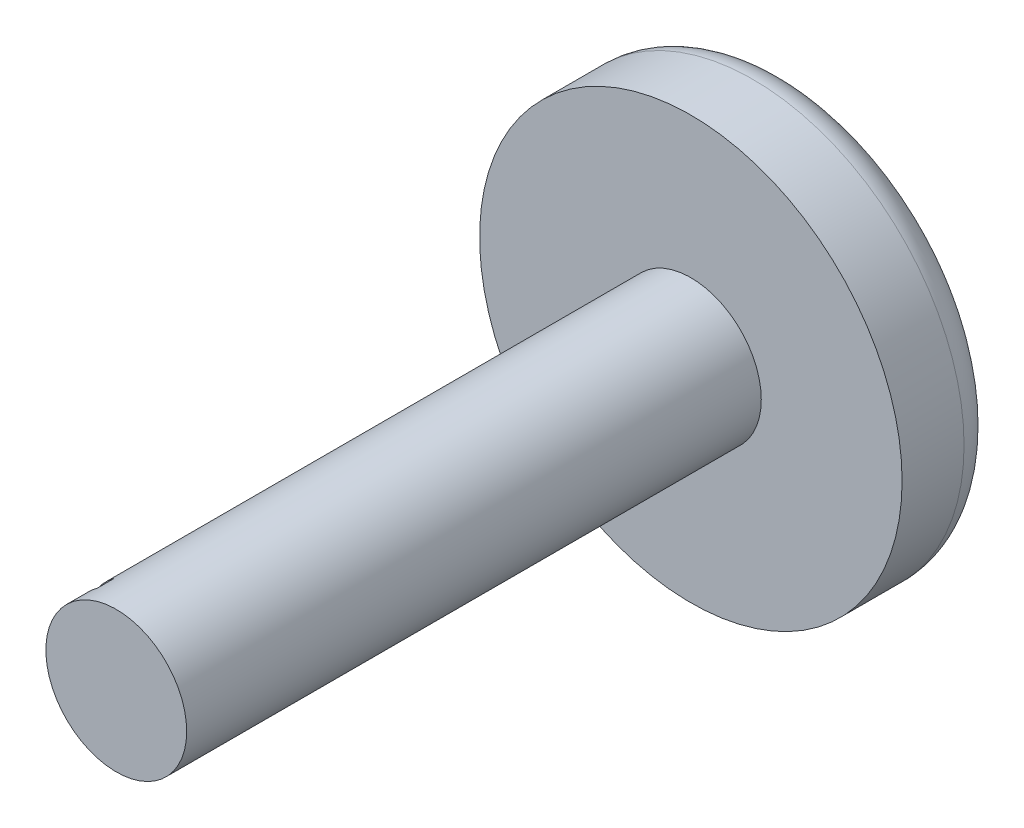
ISO-10303-21;
HEADER;
FILE_DESCRIPTION(('STEP AP214'),'2;1');
FILE_NAME('part.step','',(''),(''),'','','');
FILE_SCHEMA(('AUTOMOTIVE_DESIGN { 1 0 10303 214 1 1 1 1 }'));
ENDSEC;
DATA;
#1=APPLICATION_CONTEXT('core data for automotive mechanical design processes');
#2=APPLICATION_PROTOCOL_DEFINITION('international standard','automotive_design',2000,#1);
#3=PRODUCT_CONTEXT('',#1,'mechanical');
#4=PRODUCT('Part','Part','',(#3));
#5=PRODUCT_RELATED_PRODUCT_CATEGORY('part','',(#4));
#6=PRODUCT_DEFINITION_FORMATION('','',#4);
#7=PRODUCT_DEFINITION_CONTEXT('part definition',#1,'design');
#8=PRODUCT_DEFINITION('design','',#6,#7);
#9=PRODUCT_DEFINITION_SHAPE('','',#8);
#10=(LENGTH_UNIT() NAMED_UNIT(*) SI_UNIT(.MILLI.,.METRE.));
#11=(NAMED_UNIT(*) PLANE_ANGLE_UNIT() SI_UNIT($,.RADIAN.));
#12=(NAMED_UNIT(*) SI_UNIT($,.STERADIAN.) SOLID_ANGLE_UNIT());
#13=UNCERTAINTY_MEASURE_WITH_UNIT(LENGTH_MEASURE(1.E-05),#10,'distance_accuracy_value','');
#14=(GEOMETRIC_REPRESENTATION_CONTEXT(3) GLOBAL_UNCERTAINTY_ASSIGNED_CONTEXT((#13)) GLOBAL_UNIT_ASSIGNED_CONTEXT((#10,
#11,#12)) REPRESENTATION_CONTEXT('',''));
#15=CARTESIAN_POINT('',(0.,0.,0.));
#16=DIRECTION('',(0.,0.,1.));
#17=DIRECTION('',(1.,0.,0.));
#18=AXIS2_PLACEMENT_3D('',#15,#16,#17);
#19=CARTESIAN_POINT('',(0.,0.,1.7));
#20=DIRECTION('',(0.,0.,1.));
#21=DIRECTION('',(1.,0.,0.));
#22=AXIS2_PLACEMENT_3D('',#19,#20,#21);
#23=CYLINDRICAL_SURFACE('',#22,1.25);
#24=CARTESIAN_POINT('',(0.,0.,11.9));
#25=DIRECTION('',(0.,0.,1.));
#26=DIRECTION('',(1.,0.,0.));
#27=AXIS2_PLACEMENT_3D('',#24,#25,#26);
#28=CIRCLE('',#27,1.25);
#29=CARTESIAN_POINT('',(1.25,0.,11.9));
#30=VERTEX_POINT('',#29);
#31=EDGE_CURVE('E109',#30,#30,#28,.T.);
#32=ORIENTED_EDGE('',*,*,#31,.F.);
#33=EDGE_LOOP('',(#32));
#34=FACE_BOUND('',#33,.T.);
#35=CARTESIAN_POINT('',(0.,0.,1.7));
#36=DIRECTION('',(0.,0.,1.));
#37=DIRECTION('',(1.,0.,0.));
#38=AXIS2_PLACEMENT_3D('',#35,#36,#37);
#39=CIRCLE('',#38,1.25);
#40=CARTESIAN_POINT('',(1.25,0.,1.7));
#41=VERTEX_POINT('',#40);
#42=EDGE_CURVE('E112',#41,#41,#39,.T.);
#43=ORIENTED_EDGE('',*,*,#42,.T.);
#44=EDGE_LOOP('',(#43));
#45=FACE_BOUND('',#44,.T.);
#46=DIRECTION('',(0.,0.,1.));
#47=VECTOR('',#46,1.);
#48=CARTESIAN_POINT('',(-0.732124859719739,-1.01316000206303,11.2));
#49=LINE('',#48,#47);
#50=CARTESIAN_POINT('',(-0.732124859719739,-1.01316000206303,11.2));
#51=VERTEX_POINT('',#50);
#52=CARTESIAN_POINT('',(-0.732124859719738,-1.01316000206303,11.5));
#53=VERTEX_POINT('',#52);
#54=EDGE_CURVE('E88',#51,#53,#49,.T.);
#55=ORIENTED_EDGE('',*,*,#54,.F.);
#56=CARTESIAN_POINT('',(0.,0.,11.2));
#57=DIRECTION('',(0.,0.,1.));
#58=DIRECTION('',(1.,0.,0.));
#59=AXIS2_PLACEMENT_3D('',#56,#57,#58);
#60=CIRCLE('',#59,1.25);
#61=CARTESIAN_POINT('',(-0.732124859719739,1.01316000206303,11.2));
#62=VERTEX_POINT('',#61);
#63=EDGE_CURVE('E93',#62,#51,#60,.T.);
#64=ORIENTED_EDGE('',*,*,#63,.F.);
#65=DIRECTION('',(0.,0.,1.));
#66=VECTOR('',#65,1.);
#67=CARTESIAN_POINT('',(-0.732124859719739,1.01316000206303,11.2));
#68=LINE('',#67,#66);
#69=CARTESIAN_POINT('',(-0.732124859719739,1.01316000206303,11.5));
#70=VERTEX_POINT('',#69);
#71=EDGE_CURVE('E78',#62,#70,#68,.T.);
#72=ORIENTED_EDGE('',*,*,#71,.T.);
#73=CARTESIAN_POINT('',(0.,0.,11.5));
#74=DIRECTION('',(0.,0.,1.));
#75=DIRECTION('',(1.,0.,0.));
#76=AXIS2_PLACEMENT_3D('',#73,#74,#75);
#77=CIRCLE('',#76,1.25);
#78=EDGE_CURVE('E105',#70,#53,#77,.T.);
#79=ORIENTED_EDGE('',*,*,#78,.T.);
#80=EDGE_LOOP('',(#55,#64,#72,#79));
#81=FACE_BOUND('',#80,.T.);
#82=ADVANCED_FACE('F32',(#34,#45,#81),#23,.T.);
#83=CARTESIAN_POINT('',(0.,0.,11.9));
#84=DIRECTION('',(0.,0.,-1.));
#85=DIRECTION('',(-1.,0.,0.));
#86=AXIS2_PLACEMENT_3D('',#83,#84,#85);
#87=CYLINDRICAL_SURFACE('',#86,3.75);
#88=CARTESIAN_POINT('',(0.,0.,0.6));
#89=DIRECTION('',(0.,0.,1.));
#90=DIRECTION('',(1.,0.,0.));
#91=AXIS2_PLACEMENT_3D('',#88,#89,#90);
#92=CIRCLE('',#91,3.75);
#93=CARTESIAN_POINT('',(3.75,0.,0.6));
#94=VERTEX_POINT('',#93);
#95=EDGE_CURVE('E40',#94,#94,#92,.T.);
#96=ORIENTED_EDGE('',*,*,#95,.T.);
#97=EDGE_LOOP('',(#96));
#98=FACE_BOUND('',#97,.T.);
#99=CARTESIAN_POINT('',(0.,0.,1.7));
#100=DIRECTION('',(0.,0.,1.));
#101=DIRECTION('',(1.,0.,0.));
#102=AXIS2_PLACEMENT_3D('',#99,#100,#101);
#103=CIRCLE('',#102,3.75);
#104=CARTESIAN_POINT('',(3.75,0.,1.7));
#105=VERTEX_POINT('',#104);
#106=EDGE_CURVE('E115',#105,#105,#103,.T.);
#107=ORIENTED_EDGE('',*,*,#106,.F.);
#108=EDGE_LOOP('',(#107));
#109=FACE_BOUND('',#108,.T.);
#110=ADVANCED_FACE('F122',(#98,#109),#87,.T.);
#111=CARTESIAN_POINT('',(0.,0.,0.));
#112=DIRECTION('',(0.,0.,1.));
#113=DIRECTION('',(1.,0.,0.));
#114=AXIS2_PLACEMENT_3D('',#111,#112,#113);
#115=PLANE('',#114);
#116=CARTESIAN_POINT('',(0.,0.,0.));
#117=DIRECTION('',(0.,0.,1.));
#118=DIRECTION('',(1.,0.,0.));
#119=AXIS2_PLACEMENT_3D('',#116,#117,#118);
#120=CIRCLE('',#119,3.15);
#121=CARTESIAN_POINT('',(3.15,0.,0.));
#122=VERTEX_POINT('',#121);
#123=EDGE_CURVE('E11',#122,#122,#120,.F.);
#124=ORIENTED_EDGE('',*,*,#123,.T.);
#125=EDGE_LOOP('',(#124));
#126=FACE_BOUND('',#125,.T.);
#127=ADVANCED_FACE('F145',(#126),#115,.F.);
#128=CARTESIAN_POINT('',(0.,0.,1.7));
#129=DIRECTION('',(0.,0.,1.));
#130=DIRECTION('',(1.,0.,0.));
#131=AXIS2_PLACEMENT_3D('',#128,#129,#130);
#132=PLANE('',#131);
#133=ORIENTED_EDGE('',*,*,#42,.F.);
#134=EDGE_LOOP('',(#133));
#135=FACE_BOUND('',#134,.T.);
#136=ORIENTED_EDGE('',*,*,#106,.T.);
#137=EDGE_LOOP('',(#136));
#138=FACE_BOUND('',#137,.T.);
#139=ADVANCED_FACE('F135',(#135,#138),#132,.T.);
#140=CARTESIAN_POINT('',(0.,0.,11.9));
#141=DIRECTION('',(0.,0.,1.));
#142=DIRECTION('',(1.,0.,0.));
#143=AXIS2_PLACEMENT_3D('',#140,#141,#142);
#144=PLANE('',#143);
#145=ORIENTED_EDGE('',*,*,#31,.T.);
#146=EDGE_LOOP('',(#145));
#147=FACE_BOUND('',#146,.T.);
#148=ADVANCED_FACE('F127',(#147),#144,.T.);
#149=CARTESIAN_POINT('',(0.,0.,0.6));
#150=DIRECTION('',(0.,0.,1.));
#151=DIRECTION('',(1.,0.,0.));
#152=AXIS2_PLACEMENT_3D('',#149,#150,#151);
#153=TOROIDAL_SURFACE('',#152,3.15,0.6);
#154=ORIENTED_EDGE('',*,*,#123,.F.);
#155=EDGE_LOOP('',(#154));
#156=FACE_BOUND('',#155,.T.);
#157=ORIENTED_EDGE('',*,*,#95,.F.);
#158=EDGE_LOOP('',(#157));
#159=FACE_BOUND('',#158,.T.);
#160=ADVANCED_FACE('F34',(#156,#159),#153,.T.);
#161=CARTESIAN_POINT('',(0.,-0.466411963748117,11.2));
#162=DIRECTION('',(1.,0.,0.));
#163=DIRECTION('',(0.,0.,-1.));
#164=AXIS2_PLACEMENT_3D('',#161,#162,#163);
#165=PLANE('',#164);
#166=DIRECTION('',(0.,1.,0.));
#167=VECTOR('',#166,1.);
#168=CARTESIAN_POINT('',(0.,-0.466411963748117,11.5));
#169=LINE('',#168,#167);
#170=CARTESIAN_POINT('',(0.,-0.466411963748117,11.5));
#171=VERTEX_POINT('',#170);
#172=CARTESIAN_POINT('',(0.,0.466411963748116,11.5));
#173=VERTEX_POINT('',#172);
#174=EDGE_CURVE('E102',#171,#173,#169,.T.);
#175=ORIENTED_EDGE('',*,*,#174,.T.);
#176=DIRECTION('',(0.,0.,1.));
#177=VECTOR('',#176,1.);
#178=CARTESIAN_POINT('',(0.,0.466411963748116,11.2));
#179=LINE('',#178,#177);
#180=CARTESIAN_POINT('',(0.,0.466411963748116,11.2));
#181=VERTEX_POINT('',#180);
#182=EDGE_CURVE('E72',#181,#173,#179,.T.);
#183=ORIENTED_EDGE('',*,*,#182,.F.);
#184=DIRECTION('',(0.,1.,0.));
#185=VECTOR('',#184,1.);
#186=CARTESIAN_POINT('',(0.,-0.466411963748117,11.2));
#187=LINE('',#186,#185);
#188=CARTESIAN_POINT('',(0.,-0.466411963748117,11.2));
#189=VERTEX_POINT('',#188);
#190=EDGE_CURVE('E94',#189,#181,#187,.T.);
#191=ORIENTED_EDGE('',*,*,#190,.F.);
#192=DIRECTION('',(0.,0.,1.));
#193=VECTOR('',#192,1.);
#194=CARTESIAN_POINT('',(0.,-0.466411963748117,11.2));
#195=LINE('',#194,#193);
#196=EDGE_CURVE('E55',#189,#171,#195,.T.);
#197=ORIENTED_EDGE('',*,*,#196,.T.);
#198=EDGE_LOOP('',(#175,#183,#191,#197));
#199=FACE_BOUND('',#198,.T.);
#200=ADVANCED_FACE('F126',(#199),#165,.F.);
#201=CARTESIAN_POINT('',(0.,-0.466411963748117,11.2));
#202=DIRECTION('',(0.598355848792179,-0.801230477588185,0.));
#203=DIRECTION('',(0.801230477588185,0.598355848792179,0.));
#204=AXIS2_PLACEMENT_3D('',#201,#202,#203);
#205=PLANE('',#204);
#206=DIRECTION('',(0.801230477588185,0.598355848792179,0.));
#207=VECTOR('',#206,1.);
#208=CARTESIAN_POINT('',(0.,-0.466411963748117,11.5));
#209=LINE('',#208,#207);
#210=EDGE_CURVE('E47',#53,#171,#209,.T.);
#211=ORIENTED_EDGE('',*,*,#210,.T.);
#212=ORIENTED_EDGE('',*,*,#196,.F.);
#213=DIRECTION('',(0.801230477588185,0.598355848792179,0.));
#214=VECTOR('',#213,1.);
#215=CARTESIAN_POINT('',(0.,-0.466411963748117,11.2));
#216=LINE('',#215,#214);
#217=EDGE_CURVE('E97',#51,#189,#216,.T.);
#218=ORIENTED_EDGE('',*,*,#217,.F.);
#219=ORIENTED_EDGE('',*,*,#54,.T.);
#220=EDGE_LOOP('',(#211,#212,#218,#219));
#221=FACE_BOUND('',#220,.T.);
#222=ADVANCED_FACE('F133',(#221),#205,.F.);
#223=CARTESIAN_POINT('',(0.,0.466411963748116,11.2));
#224=DIRECTION('',(0.598355848792179,0.801230477588185,0.));
#225=DIRECTION('',(-0.801230477588185,0.598355848792179,0.));
#226=AXIS2_PLACEMENT_3D('',#223,#224,#225);
#227=PLANE('',#226);
#228=DIRECTION('',(-0.801230477588185,0.598355848792179,0.));
#229=VECTOR('',#228,1.);
#230=CARTESIAN_POINT('',(0.,0.466411963748116,11.5));
#231=LINE('',#230,#229);
#232=EDGE_CURVE('E84',#173,#70,#231,.T.);
#233=ORIENTED_EDGE('',*,*,#232,.T.);
#234=ORIENTED_EDGE('',*,*,#71,.F.);
#235=DIRECTION('',(-0.801230477588185,0.598355848792179,0.));
#236=VECTOR('',#235,1.);
#237=CARTESIAN_POINT('',(0.,0.466411963748116,11.2));
#238=LINE('',#237,#236);
#239=EDGE_CURVE('E81',#181,#62,#238,.T.);
#240=ORIENTED_EDGE('',*,*,#239,.F.);
#241=ORIENTED_EDGE('',*,*,#182,.T.);
#242=EDGE_LOOP('',(#233,#234,#240,#241));
#243=FACE_BOUND('',#242,.T.);
#244=ADVANCED_FACE('F80',(#243),#227,.F.);
#245=CARTESIAN_POINT('',(0.,0.,11.2));
#246=DIRECTION('',(0.,0.,1.));
#247=DIRECTION('',(1.,0.,0.));
#248=AXIS2_PLACEMENT_3D('',#245,#246,#247);
#249=PLANE('',#248);
#250=ORIENTED_EDGE('',*,*,#190,.T.);
#251=ORIENTED_EDGE('',*,*,#239,.T.);
#252=ORIENTED_EDGE('',*,*,#63,.T.);
#253=ORIENTED_EDGE('',*,*,#217,.T.);
#254=EDGE_LOOP('',(#250,#251,#252,#253));
#255=FACE_BOUND('',#254,.T.);
#256=ADVANCED_FACE('F91',(#255),#249,.T.);
#257=CARTESIAN_POINT('',(0.,0.,11.5));
#258=DIRECTION('',(0.,0.,1.));
#259=DIRECTION('',(1.,0.,0.));
#260=AXIS2_PLACEMENT_3D('',#257,#258,#259);
#261=PLANE('',#260);
#262=ORIENTED_EDGE('',*,*,#174,.F.);
#263=ORIENTED_EDGE('',*,*,#210,.F.);
#264=ORIENTED_EDGE('',*,*,#78,.F.);
#265=ORIENTED_EDGE('',*,*,#232,.F.);
#266=EDGE_LOOP('',(#262,#263,#264,#265));
#267=FACE_BOUND('',#266,.T.);
#268=ADVANCED_FACE('F209',(#267),#261,.F.);
#269=CLOSED_SHELL('',(#82,#110,#127,#139,#148,#160,#200,#222,#244,#256,#268));
#270=MANIFOLD_SOLID_BREP('B2',#269);
#271=ADVANCED_BREP_SHAPE_REPRESENTATION('',(#18,#270),#14);
#272=SHAPE_DEFINITION_REPRESENTATION(#9,#271);
ENDSEC;
END-ISO-10303-21;
